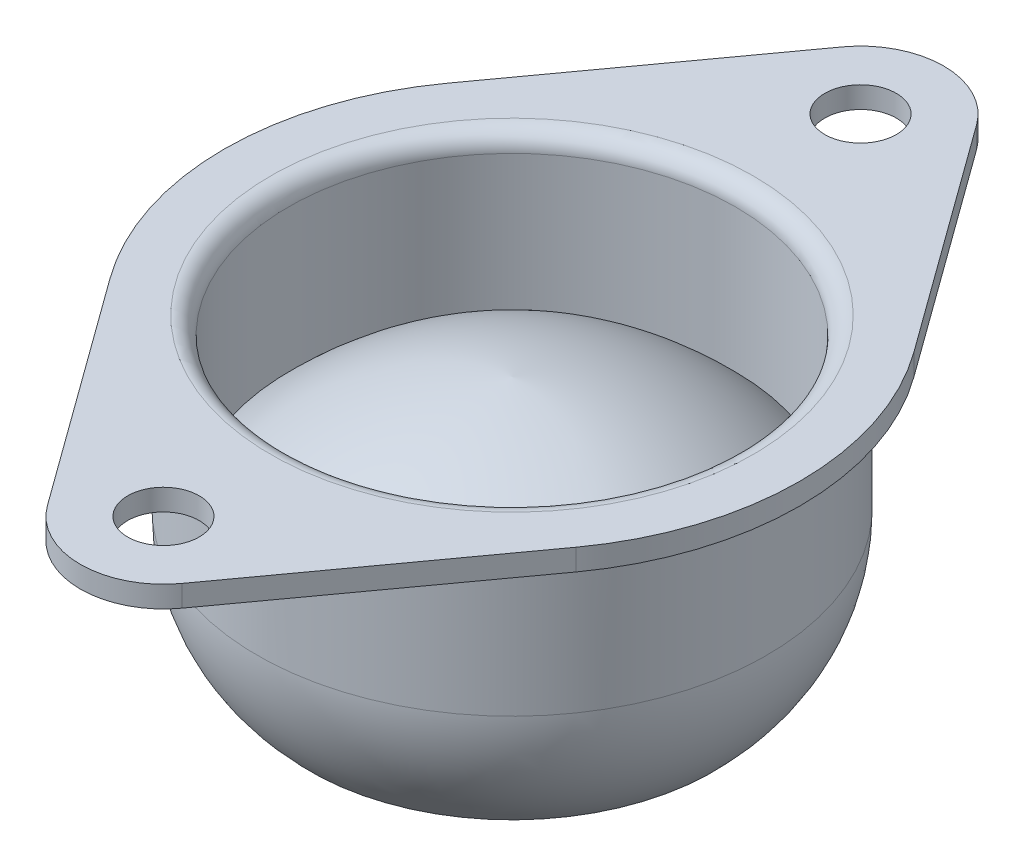
ISO-10303-21;
HEADER;
FILE_DESCRIPTION(('STEP AP214'),'2;1');
FILE_NAME('part.step','',(''),(''),'','','');
FILE_SCHEMA(('AUTOMOTIVE_DESIGN { 1 0 10303 214 1 1 1 1 }'));
ENDSEC;
DATA;
#1=APPLICATION_CONTEXT('core data for automotive mechanical design processes');
#2=APPLICATION_PROTOCOL_DEFINITION('international standard','automotive_design',2000,#1);
#3=PRODUCT_CONTEXT('',#1,'mechanical');
#4=PRODUCT('Part','Part','',(#3));
#5=PRODUCT_RELATED_PRODUCT_CATEGORY('part','',(#4));
#6=PRODUCT_DEFINITION_FORMATION('','',#4);
#7=PRODUCT_DEFINITION_CONTEXT('part definition',#1,'design');
#8=PRODUCT_DEFINITION('design','',#6,#7);
#9=PRODUCT_DEFINITION_SHAPE('','',#8);
#10=(LENGTH_UNIT() NAMED_UNIT(*) SI_UNIT(.MILLI.,.METRE.));
#11=(NAMED_UNIT(*) PLANE_ANGLE_UNIT() SI_UNIT($,.RADIAN.));
#12=(NAMED_UNIT(*) SI_UNIT($,.STERADIAN.) SOLID_ANGLE_UNIT());
#13=UNCERTAINTY_MEASURE_WITH_UNIT(LENGTH_MEASURE(1.E-05),#10,'distance_accuracy_value','');
#14=(GEOMETRIC_REPRESENTATION_CONTEXT(3) GLOBAL_UNCERTAINTY_ASSIGNED_CONTEXT((#13)) GLOBAL_UNIT_ASSIGNED_CONTEXT((#10,
#11,#12)) REPRESENTATION_CONTEXT('',''));
#15=CARTESIAN_POINT('',(0.,0.,0.));
#16=DIRECTION('',(0.,0.,1.));
#17=DIRECTION('',(1.,0.,0.));
#18=AXIS2_PLACEMENT_3D('',#15,#16,#17);
#19=CARTESIAN_POINT('',(0.,-4.21271556201627,0.));
#20=DIRECTION('',(0.,-1.,0.));
#21=DIRECTION('',(0.,0.,-1.));
#22=AXIS2_PLACEMENT_3D('',#19,#20,#21);
#23=CYLINDRICAL_SURFACE('',#22,9.2);
#24=CARTESIAN_POINT('',(0.,-4.21271556201627,0.));
#25=DIRECTION('',(0.,-1.,0.));
#26=DIRECTION('',(0.,0.,-1.));
#27=AXIS2_PLACEMENT_3D('',#24,#25,#26);
#28=CIRCLE('',#27,9.2);
#29=CARTESIAN_POINT('',(-7.44700221203728,-4.21271556201627,5.40205128205128));
#30=VERTEX_POINT('',#29);
#31=CARTESIAN_POINT('',(-7.44700221203728,-4.21271556201627,-5.40205128205128));
#32=VERTEX_POINT('',#31);
#33=EDGE_CURVE('E185',#30,#32,#28,.T.);
#34=ORIENTED_EDGE('',*,*,#33,.T.);
#35=DIRECTION('',(0.,1.,0.));
#36=VECTOR('',#35,1.);
#37=CARTESIAN_POINT('',(-7.44700221203728,-38.0695015819993,-5.40205128205128));
#38=LINE('',#37,#36);
#39=CARTESIAN_POINT('',(-7.44700221203728,-4.89842984773056,-5.40205128205128));
#40=VERTEX_POINT('',#39);
#41=EDGE_CURVE('E165',#40,#32,#38,.T.);
#42=ORIENTED_EDGE('',*,*,#41,.F.);
#43=CARTESIAN_POINT('',(0.,-4.89842984773056,0.));
#44=DIRECTION('',(0.,-1.,0.));
#45=DIRECTION('',(0.,0.,-1.));
#46=AXIS2_PLACEMENT_3D('',#43,#44,#45);
#47=CIRCLE('',#46,9.2);
#48=CARTESIAN_POINT('',(-7.44700221203727,-4.89842984773056,5.40205128205128));
#49=VERTEX_POINT('',#48);
#50=EDGE_CURVE('E181',#49,#40,#47,.T.);
#51=ORIENTED_EDGE('',*,*,#50,.F.);
#52=DIRECTION('',(0.,1.,0.));
#53=VECTOR('',#52,1.);
#54=CARTESIAN_POINT('',(-7.44700221203728,-38.0695015819993,5.40205128205128));
#55=LINE('',#54,#53);
#56=EDGE_CURVE('E53',#49,#30,#55,.T.);
#57=ORIENTED_EDGE('',*,*,#56,.T.);
#58=EDGE_LOOP('',(#34,#42,#51,#57));
#59=FACE_BOUND('',#58,.T.);
#60=ADVANCED_FACE('F38',(#59),#23,.T.);
#61=CARTESIAN_POINT('',(0.,-4.21271556201627,0.));
#62=DIRECTION('',(0.,-1.,0.));
#63=DIRECTION('',(0.,0.,-1.));
#64=AXIS2_PLACEMENT_3D('',#61,#62,#63);
#65=PLANE('',#64);
#66=CARTESIAN_POINT('',(0.,-4.21271556201627,0.));
#67=DIRECTION('',(0.,-1.,0.));
#68=DIRECTION('',(0.,0.,-1.));
#69=AXIS2_PLACEMENT_3D('',#66,#67,#68);
#70=CIRCLE('',#69,7.71428571428572);
#71=CARTESIAN_POINT('',(0.,-4.21271556201627,-7.71428571428572));
#72=VERTEX_POINT('',#71);
#73=EDGE_CURVE('E192',#72,#72,#70,.T.);
#74=ORIENTED_EDGE('',*,*,#73,.T.);
#75=EDGE_LOOP('',(#74));
#76=FACE_BOUND('',#75,.T.);
#77=CARTESIAN_POINT('',(7.44700221203728,-4.21271556201627,-5.40205128205128));
#78=VERTEX_POINT('',#77);
#79=CARTESIAN_POINT('',(7.44700221203728,-4.21271556201627,5.40205128205128));
#80=VERTEX_POINT('',#79);
#81=EDGE_CURVE('E186',#78,#80,#28,.T.);
#82=ORIENTED_EDGE('',*,*,#81,.F.);
#83=DIRECTION('',(0.587179487179487,0.,0.809456762177965));
#84=VECTOR('',#83,1.);
#85=CARTESIAN_POINT('',(7.44700221203727,-4.21271556201627,-5.40205128205128));
#86=LINE('',#85,#84);
#87=CARTESIAN_POINT('',(2.15084225378716,-4.21271556201627,-12.7030769230769));
#88=VERTEX_POINT('',#87);
#89=EDGE_CURVE('E119',#88,#78,#86,.T.);
#90=ORIENTED_EDGE('',*,*,#89,.F.);
#91=CARTESIAN_POINT('',(0.,-4.21271556201627,-11.1428571428571));
#92=DIRECTION('',(0.,1.,0.));
#93=DIRECTION('',(0.,0.,1.));
#94=AXIS2_PLACEMENT_3D('',#91,#92,#93);
#95=CIRCLE('',#94,2.65714285714286);
#96=CARTESIAN_POINT('',(-2.15084225378716,-4.21271556201627,-12.7030769230769));
#97=VERTEX_POINT('',#96);
#98=EDGE_CURVE('E139',#88,#97,#95,.T.);
#99=ORIENTED_EDGE('',*,*,#98,.T.);
#100=DIRECTION('',(-0.587179487179487,0.,0.809456762177965));
#101=VECTOR('',#100,1.);
#102=CARTESIAN_POINT('',(-7.44700221203728,-4.21271556201627,-5.40205128205128));
#103=LINE('',#102,#101);
#104=EDGE_CURVE('E142',#97,#32,#103,.T.);
#105=ORIENTED_EDGE('',*,*,#104,.T.);
#106=ORIENTED_EDGE('',*,*,#33,.F.);
#107=DIRECTION('',(-0.587179487179487,0.,-0.809456762177965));
#108=VECTOR('',#107,1.);
#109=CARTESIAN_POINT('',(-7.44700221203728,-4.21271556201627,5.40205128205128));
#110=LINE('',#109,#108);
#111=CARTESIAN_POINT('',(-2.15084225378716,-4.21271556201627,12.7030769230769));
#112=VERTEX_POINT('',#111);
#113=EDGE_CURVE('E145',#112,#30,#110,.T.);
#114=ORIENTED_EDGE('',*,*,#113,.F.);
#115=CARTESIAN_POINT('',(0.,-4.21271556201627,11.1428571428571));
#116=DIRECTION('',(0.,1.,0.));
#117=DIRECTION('',(0.,0.,1.));
#118=AXIS2_PLACEMENT_3D('',#115,#116,#117);
#119=CIRCLE('',#118,2.65714285714286);
#120=CARTESIAN_POINT('',(2.15084225378716,-4.21271556201627,12.7030769230769));
#121=VERTEX_POINT('',#120);
#122=EDGE_CURVE('E147',#112,#121,#119,.T.);
#123=ORIENTED_EDGE('',*,*,#122,.T.);
#124=DIRECTION('',(0.587179487179487,0.,-0.809456762177965));
#125=VECTOR('',#124,1.);
#126=CARTESIAN_POINT('',(7.44700221203727,-4.21271556201627,5.40205128205128));
#127=LINE('',#126,#125);
#128=EDGE_CURVE('E150',#121,#80,#127,.T.);
#129=ORIENTED_EDGE('',*,*,#128,.T.);
#130=EDGE_LOOP('',(#82,#90,#99,#105,#106,#114,#123,#129));
#131=FACE_BOUND('',#130,.T.);
#132=CARTESIAN_POINT('',(0.,-4.21271556201627,11.1428571428571));
#133=DIRECTION('',(0.,1.,0.));
#134=DIRECTION('',(0.,0.,1.));
#135=AXIS2_PLACEMENT_3D('',#132,#133,#134);
#136=CIRCLE('',#135,1.14285714285714);
#137=CARTESIAN_POINT('',(0.,-4.21271556201627,12.2857142857143));
#138=VERTEX_POINT('',#137);
#139=EDGE_CURVE('E153',#138,#138,#136,.T.);
#140=ORIENTED_EDGE('',*,*,#139,.F.);
#141=EDGE_LOOP('',(#140));
#142=FACE_BOUND('',#141,.T.);
#143=CARTESIAN_POINT('',(0.,-4.21271556201627,-11.1428571428571));
#144=DIRECTION('',(0.,1.,0.));
#145=DIRECTION('',(0.,0.,1.));
#146=AXIS2_PLACEMENT_3D('',#143,#144,#145);
#147=CIRCLE('',#146,1.14285714285714);
#148=CARTESIAN_POINT('',(0.,-4.21271556201627,-10.));
#149=VERTEX_POINT('',#148);
#150=EDGE_CURVE('E116',#149,#149,#147,.T.);
#151=ORIENTED_EDGE('',*,*,#150,.F.);
#152=EDGE_LOOP('',(#151));
#153=FACE_BOUND('',#152,.T.);
#154=ADVANCED_FACE('F209',(#76,#131,#142,#153),#65,.F.);
#155=ORIENTED_EDGE('',*,*,#81,.T.);
#156=DIRECTION('',(0.,1.,0.));
#157=VECTOR('',#156,1.);
#158=CARTESIAN_POINT('',(7.44700221203728,-38.0695015819993,5.40205128205128));
#159=LINE('',#158,#157);
#160=CARTESIAN_POINT('',(7.44700221203727,-4.89842984773056,5.40205128205128));
#161=VERTEX_POINT('',#160);
#162=EDGE_CURVE('E158',#161,#80,#159,.T.);
#163=ORIENTED_EDGE('',*,*,#162,.F.);
#164=CARTESIAN_POINT('',(7.44700221203727,-4.89842984773056,-5.40205128205128));
#165=VERTEX_POINT('',#164);
#166=EDGE_CURVE('E182',#165,#161,#47,.T.);
#167=ORIENTED_EDGE('',*,*,#166,.F.);
#168=DIRECTION('',(0.,1.,0.));
#169=VECTOR('',#168,1.);
#170=CARTESIAN_POINT('',(7.44700221203728,-38.0695015819993,-5.40205128205128));
#171=LINE('',#170,#169);
#172=EDGE_CURVE('E61',#165,#78,#171,.T.);
#173=ORIENTED_EDGE('',*,*,#172,.T.);
#174=EDGE_LOOP('',(#155,#163,#167,#173));
#175=FACE_BOUND('',#174,.T.);
#176=ADVANCED_FACE('F212',(#175),#23,.T.);
#177=CARTESIAN_POINT('',(-9.2,-4.89842984773056,0.));
#178=DIRECTION('',(0.,1.,0.));
#179=DIRECTION('',(0.,0.,1.));
#180=AXIS2_PLACEMENT_3D('',#177,#178,#179);
#181=PLANE('',#180);
#182=CARTESIAN_POINT('',(0.,-4.89842984773056,0.));
#183=DIRECTION('',(0.,1.,0.));
#184=DIRECTION('',(0.,0.,1.));
#185=AXIS2_PLACEMENT_3D('',#182,#183,#184);
#186=CIRCLE('',#185,8.71428571428571);
#187=CARTESIAN_POINT('',(0.,-4.89842984773056,8.71428571428571));
#188=VERTEX_POINT('',#187);
#189=EDGE_CURVE('E11',#188,#188,#186,.T.);
#190=ORIENTED_EDGE('',*,*,#189,.T.);
#191=EDGE_LOOP('',(#190));
#192=FACE_BOUND('',#191,.T.);
#193=ORIENTED_EDGE('',*,*,#166,.T.);
#194=DIRECTION('',(-0.587179487179487,0.,0.809456762177965));
#195=VECTOR('',#194,1.);
#196=CARTESIAN_POINT('',(7.44700221203727,-4.89842984773056,5.40205128205128));
#197=LINE('',#196,#195);
#198=CARTESIAN_POINT('',(2.15084225378716,-4.89842984773056,12.7030769230769));
#199=VERTEX_POINT('',#198);
#200=EDGE_CURVE('E135',#161,#199,#197,.T.);
#201=ORIENTED_EDGE('',*,*,#200,.T.);
#202=CARTESIAN_POINT('',(0.,-4.89842984773056,11.1428571428571));
#203=DIRECTION('',(0.,1.,0.));
#204=DIRECTION('',(0.,0.,1.));
#205=AXIS2_PLACEMENT_3D('',#202,#203,#204);
#206=CIRCLE('',#205,2.65714285714286);
#207=CARTESIAN_POINT('',(-2.15084225378716,-4.89842984773056,12.7030769230769));
#208=VERTEX_POINT('',#207);
#209=EDGE_CURVE('E133',#199,#208,#206,.F.);
#210=ORIENTED_EDGE('',*,*,#209,.T.);
#211=DIRECTION('',(0.587179487179487,0.,0.809456762177965));
#212=VECTOR('',#211,1.);
#213=CARTESIAN_POINT('',(-7.44700221203728,-4.89842984773056,5.40205128205128));
#214=LINE('',#213,#212);
#215=EDGE_CURVE('E131',#49,#208,#214,.T.);
#216=ORIENTED_EDGE('',*,*,#215,.F.);
#217=ORIENTED_EDGE('',*,*,#50,.T.);
#218=DIRECTION('',(0.587179487179487,0.,-0.809456762177965));
#219=VECTOR('',#218,1.);
#220=CARTESIAN_POINT('',(-7.44700221203728,-4.89842984773056,-5.40205128205128));
#221=LINE('',#220,#219);
#222=CARTESIAN_POINT('',(-2.15084225378716,-4.89842984773056,-12.7030769230769));
#223=VERTEX_POINT('',#222);
#224=EDGE_CURVE('E129',#40,#223,#221,.T.);
#225=ORIENTED_EDGE('',*,*,#224,.T.);
#226=CARTESIAN_POINT('',(0.,-4.89842984773056,-11.1428571428571));
#227=DIRECTION('',(0.,1.,0.));
#228=DIRECTION('',(0.,0.,1.));
#229=AXIS2_PLACEMENT_3D('',#226,#227,#228);
#230=CIRCLE('',#229,2.65714285714286);
#231=CARTESIAN_POINT('',(2.15084225378716,-4.89842984773056,-12.7030769230769));
#232=VERTEX_POINT('',#231);
#233=EDGE_CURVE('E126',#223,#232,#230,.F.);
#234=ORIENTED_EDGE('',*,*,#233,.T.);
#235=DIRECTION('',(-0.587179487179487,0.,-0.809456762177965));
#236=VECTOR('',#235,1.);
#237=CARTESIAN_POINT('',(7.44700221203727,-4.89842984773056,-5.40205128205128));
#238=LINE('',#237,#236);
#239=EDGE_CURVE('E128',#165,#232,#238,.T.);
#240=ORIENTED_EDGE('',*,*,#239,.F.);
#241=EDGE_LOOP('',(#193,#201,#210,#216,#217,#225,#234,#240));
#242=FACE_BOUND('',#241,.T.);
#243=CARTESIAN_POINT('',(0.,-4.89842984773056,11.1428571428571));
#244=DIRECTION('',(0.,1.,0.));
#245=DIRECTION('',(0.,0.,1.));
#246=AXIS2_PLACEMENT_3D('',#243,#244,#245);
#247=CIRCLE('',#246,1.14285714285714);
#248=CARTESIAN_POINT('',(0.,-4.89842984773056,12.2857142857143));
#249=VERTEX_POINT('',#248);
#250=EDGE_CURVE('E125',#249,#249,#247,.F.);
#251=ORIENTED_EDGE('',*,*,#250,.F.);
#252=EDGE_LOOP('',(#251));
#253=FACE_BOUND('',#252,.T.);
#254=CARTESIAN_POINT('',(0.,-4.89842984773056,-11.1428571428571));
#255=DIRECTION('',(0.,1.,0.));
#256=DIRECTION('',(0.,0.,1.));
#257=AXIS2_PLACEMENT_3D('',#254,#255,#256);
#258=CIRCLE('',#257,1.14285714285714);
#259=CARTESIAN_POINT('',(0.,-4.89842984773056,-10.));
#260=VERTEX_POINT('',#259);
#261=EDGE_CURVE('E122',#260,#260,#258,.F.);
#262=ORIENTED_EDGE('',*,*,#261,.F.);
#263=EDGE_LOOP('',(#262));
#264=FACE_BOUND('',#263,.T.);
#265=ADVANCED_FACE('F221',(#192,#242,#253,#264),#181,.F.);
#266=CARTESIAN_POINT('',(0.,-4.21271556201627,0.));
#267=DIRECTION('',(0.,-1.,0.));
#268=DIRECTION('',(0.,0.,-1.));
#269=AXIS2_PLACEMENT_3D('',#266,#267,#268);
#270=CYLINDRICAL_SURFACE('',#269,8.14285714285714);
#271=CARTESIAN_POINT('',(0.,-5.46985841915913,0.));
#272=DIRECTION('',(0.,1.,0.));
#273=DIRECTION('',(0.,0.,1.));
#274=AXIS2_PLACEMENT_3D('',#271,#272,#273);
#275=CIRCLE('',#274,8.14285714285714);
#276=CARTESIAN_POINT('',(0.,-5.46985841915913,8.14285714285714));
#277=VERTEX_POINT('',#276);
#278=EDGE_CURVE('E46',#277,#277,#275,.F.);
#279=ORIENTED_EDGE('',*,*,#278,.T.);
#280=EDGE_LOOP('',(#279));
#281=FACE_BOUND('',#280,.T.);
#282=CARTESIAN_POINT('',(0.,-9.56047074570608,0.));
#283=DIRECTION('',(0.,-1.,0.));
#284=DIRECTION('',(0.,0.,-1.));
#285=AXIS2_PLACEMENT_3D('',#282,#283,#284);
#286=CIRCLE('',#285,8.14285714285714);
#287=CARTESIAN_POINT('',(0.,-9.56047074570608,-8.14285714285714));
#288=VERTEX_POINT('',#287);
#289=EDGE_CURVE('E178',#288,#288,#286,.T.);
#290=ORIENTED_EDGE('',*,*,#289,.F.);
#291=EDGE_LOOP('',(#290));
#292=FACE_BOUND('',#291,.T.);
#293=ADVANCED_FACE('F197',(#281,#292),#270,.T.);
#294=CARTESIAN_POINT('',(0.,-9.56047074570608,0.));
#295=DIRECTION('',(0.,-1.,0.));
#296=DIRECTION('',(0.,0.,-1.));
#297=AXIS2_PLACEMENT_3D('',#294,#295,#296);
#298=DEGENERATE_TOROIDAL_SURFACE('',#297,2.42857142857143,5.71428571428571,.T.);
#299=CARTESIAN_POINT('',(0.,-13.6412869905877,0.));
#300=DIRECTION('',(0.,-1.,0.));
#301=DIRECTION('',(0.,0.,-1.));
#302=AXIS2_PLACEMENT_3D('',#299,#300,#301);
#303=CIRCLE('',#302,6.42857142857143);
#304=CARTESIAN_POINT('',(0.,-13.6412869905877,-6.42857142857143));
#305=VERTEX_POINT('',#304);
#306=EDGE_CURVE('E175',#305,#305,#303,.T.);
#307=ORIENTED_EDGE('',*,*,#306,.F.);
#308=EDGE_LOOP('',(#307));
#309=FACE_BOUND('',#308,.T.);
#310=ORIENTED_EDGE('',*,*,#289,.T.);
#311=EDGE_LOOP('',(#310));
#312=FACE_BOUND('',#311,.T.);
#313=ADVANCED_FACE('F278',(#309,#312),#298,.T.);
#314=CARTESIAN_POINT('',(0.,-12.179534854485,0.));
#315=DIRECTION('',(0.,-1.,0.));
#316=DIRECTION('',(0.,0.,-1.));
#317=AXIS2_PLACEMENT_3D('',#314,#315,#316);
#318=TOROIDAL_SURFACE('',#317,5.53299552290893,1.71428571428571);
#319=CARTESIAN_POINT('',(0.,-13.3555727048734,0.));
#320=DIRECTION('',(0.,-1.,0.));
#321=DIRECTION('',(0.,0.,-1.));
#322=AXIS2_PLACEMENT_3D('',#319,#320,#321);
#323=CIRCLE('',#322,4.28571428571429);
#324=CARTESIAN_POINT('',(0.,-13.3555727048734,-4.28571428571429));
#325=VERTEX_POINT('',#324);
#326=EDGE_CURVE('E172',#325,#325,#323,.T.);
#327=ORIENTED_EDGE('',*,*,#326,.F.);
#328=EDGE_LOOP('',(#327));
#329=FACE_BOUND('',#328,.T.);
#330=ORIENTED_EDGE('',*,*,#306,.T.);
#331=EDGE_LOOP('',(#330));
#332=FACE_BOUND('',#331,.T.);
#333=ADVANCED_FACE('F274',(#329,#332),#318,.T.);
#334=CARTESIAN_POINT('',(0.,-11.5698584191591,0.));
#335=DIRECTION('',(0.,-1.,0.));
#336=DIRECTION('',(-1.,0.,0.));
#337=AXIS2_PLACEMENT_3D('',#334,#335,#336);
#338=SPHERICAL_SURFACE('',#337,4.64285714285714);
#339=ORIENTED_EDGE('',*,*,#326,.T.);
#340=EDGE_LOOP('',(#339));
#341=FACE_BOUND('',#340,.T.);
#342=ADVANCED_FACE('F271',(#341),#338,.T.);
#343=CARTESIAN_POINT('',(0.,-38.0695015819993,11.1428571428571));
#344=DIRECTION('',(0.,1.,0.));
#345=DIRECTION('',(0.,0.,1.));
#346=AXIS2_PLACEMENT_3D('',#343,#344,#345);
#347=CYLINDRICAL_SURFACE('',#346,2.65714285714286);
#348=ORIENTED_EDGE('',*,*,#209,.F.);
#349=DIRECTION('',(0.,1.,0.));
#350=VECTOR('',#349,1.);
#351=CARTESIAN_POINT('',(2.15084225378716,-38.0695015819993,12.7030769230769));
#352=LINE('',#351,#350);
#353=EDGE_CURVE('E160',#199,#121,#352,.T.);
#354=ORIENTED_EDGE('',*,*,#353,.T.);
#355=ORIENTED_EDGE('',*,*,#122,.F.);
#356=DIRECTION('',(0.,1.,0.));
#357=VECTOR('',#356,1.);
#358=CARTESIAN_POINT('',(-2.15084225378716,-38.0695015819993,12.7030769230769));
#359=LINE('',#358,#357);
#360=EDGE_CURVE('E162',#208,#112,#359,.T.);
#361=ORIENTED_EDGE('',*,*,#360,.F.);
#362=EDGE_LOOP('',(#348,#354,#355,#361));
#363=FACE_BOUND('',#362,.T.);
#364=ADVANCED_FACE('F245',(#363),#347,.T.);
#365=CARTESIAN_POINT('',(0.,-38.0695015819993,11.1428571428571));
#366=DIRECTION('',(0.,1.,0.));
#367=DIRECTION('',(0.,0.,1.));
#368=AXIS2_PLACEMENT_3D('',#365,#366,#367);
#369=CYLINDRICAL_SURFACE('',#368,1.14285714285714);
#370=ORIENTED_EDGE('',*,*,#250,.T.);
#371=EDGE_LOOP('',(#370));
#372=FACE_BOUND('',#371,.T.);
#373=ORIENTED_EDGE('',*,*,#139,.T.);
#374=EDGE_LOOP('',(#373));
#375=FACE_BOUND('',#374,.T.);
#376=ADVANCED_FACE('F306',(#372,#375),#369,.F.);
#377=CARTESIAN_POINT('',(7.44700221203727,-38.0695015819993,5.40205128205128));
#378=DIRECTION('',(0.809456762177965,0.,0.587179487179487));
#379=DIRECTION('',(0.587179487179487,0.,-0.809456762177965));
#380=AXIS2_PLACEMENT_3D('',#377,#378,#379);
#381=PLANE('',#380);
#382=ORIENTED_EDGE('',*,*,#200,.F.);
#383=ORIENTED_EDGE('',*,*,#162,.T.);
#384=ORIENTED_EDGE('',*,*,#128,.F.);
#385=ORIENTED_EDGE('',*,*,#353,.F.);
#386=EDGE_LOOP('',(#382,#383,#384,#385));
#387=FACE_BOUND('',#386,.T.);
#388=ADVANCED_FACE('F239',(#387),#381,.T.);
#389=CARTESIAN_POINT('',(-7.44700221203728,-38.0695015819993,5.40205128205128));
#390=DIRECTION('',(0.809456762177965,0.,-0.587179487179487));
#391=DIRECTION('',(-0.587179487179487,0.,-0.809456762177965));
#392=AXIS2_PLACEMENT_3D('',#389,#390,#391);
#393=PLANE('',#392);
#394=ORIENTED_EDGE('',*,*,#56,.F.);
#395=ORIENTED_EDGE('',*,*,#215,.T.);
#396=ORIENTED_EDGE('',*,*,#360,.T.);
#397=ORIENTED_EDGE('',*,*,#113,.T.);
#398=EDGE_LOOP('',(#394,#395,#396,#397));
#399=FACE_BOUND('',#398,.T.);
#400=ADVANCED_FACE('F246',(#399),#393,.F.);
#401=CARTESIAN_POINT('',(0.,-38.0695015819993,-11.1428571428571));
#402=DIRECTION('',(0.,1.,0.));
#403=DIRECTION('',(0.,0.,1.));
#404=AXIS2_PLACEMENT_3D('',#401,#402,#403);
#405=CYLINDRICAL_SURFACE('',#404,2.65714285714286);
#406=ORIENTED_EDGE('',*,*,#233,.F.);
#407=DIRECTION('',(0.,1.,0.));
#408=VECTOR('',#407,1.);
#409=CARTESIAN_POINT('',(-2.15084225378716,-38.0695015819993,-12.7030769230769));
#410=LINE('',#409,#408);
#411=EDGE_CURVE('E167',#223,#97,#410,.T.);
#412=ORIENTED_EDGE('',*,*,#411,.T.);
#413=ORIENTED_EDGE('',*,*,#98,.F.);
#414=DIRECTION('',(0.,1.,0.));
#415=VECTOR('',#414,1.);
#416=CARTESIAN_POINT('',(2.15084225378716,-38.0695015819993,-12.7030769230769));
#417=LINE('',#416,#415);
#418=EDGE_CURVE('E156',#232,#88,#417,.T.);
#419=ORIENTED_EDGE('',*,*,#418,.F.);
#420=EDGE_LOOP('',(#406,#412,#413,#419));
#421=FACE_BOUND('',#420,.T.);
#422=ADVANCED_FACE('F258',(#421),#405,.T.);
#423=CARTESIAN_POINT('',(-7.44700221203728,-38.0695015819993,-5.40205128205128));
#424=DIRECTION('',(-0.809456762177965,0.,-0.587179487179487));
#425=DIRECTION('',(-0.587179487179487,0.,0.809456762177965));
#426=AXIS2_PLACEMENT_3D('',#423,#424,#425);
#427=PLANE('',#426);
#428=ORIENTED_EDGE('',*,*,#224,.F.);
#429=ORIENTED_EDGE('',*,*,#41,.T.);
#430=ORIENTED_EDGE('',*,*,#104,.F.);
#431=ORIENTED_EDGE('',*,*,#411,.F.);
#432=EDGE_LOOP('',(#428,#429,#430,#431));
#433=FACE_BOUND('',#432,.T.);
#434=ADVANCED_FACE('F255',(#433),#427,.T.);
#435=CARTESIAN_POINT('',(7.44700221203727,-38.0695015819993,-5.40205128205128));
#436=DIRECTION('',(-0.809456762177965,0.,0.587179487179487));
#437=DIRECTION('',(0.587179487179487,0.,0.809456762177965));
#438=AXIS2_PLACEMENT_3D('',#435,#436,#437);
#439=PLANE('',#438);
#440=ORIENTED_EDGE('',*,*,#172,.F.);
#441=ORIENTED_EDGE('',*,*,#239,.T.);
#442=ORIENTED_EDGE('',*,*,#418,.T.);
#443=ORIENTED_EDGE('',*,*,#89,.T.);
#444=EDGE_LOOP('',(#440,#441,#442,#443));
#445=FACE_BOUND('',#444,.T.);
#446=ADVANCED_FACE('F259',(#445),#439,.F.);
#447=CARTESIAN_POINT('',(0.,-38.0695015819993,-11.1428571428571));
#448=DIRECTION('',(0.,1.,0.));
#449=DIRECTION('',(0.,0.,1.));
#450=AXIS2_PLACEMENT_3D('',#447,#448,#449);
#451=CYLINDRICAL_SURFACE('',#450,1.14285714285714);
#452=ORIENTED_EDGE('',*,*,#261,.T.);
#453=EDGE_LOOP('',(#452));
#454=FACE_BOUND('',#453,.T.);
#455=ORIENTED_EDGE('',*,*,#150,.T.);
#456=EDGE_LOOP('',(#455));
#457=FACE_BOUND('',#456,.T.);
#458=ADVANCED_FACE('F110',(#454,#457),#451,.F.);
#459=CARTESIAN_POINT('',(0.,-17.3056127936304,-1.0674478140319));
#460=DIRECTION('',(-1.,0.,0.));
#461=DIRECTION('',(0.,0.,1.));
#462=AXIS2_PLACEMENT_3D('',#459,#460,#461);
#463=CIRCLE('',#462,11.4285714285714);
#464=TRIMMED_CURVE('',#463,(PARAMETER_VALUE(-1.47725830305523)),
(PARAMETER_VALUE(1.47725830305523)),.T.,.PARAMETER.);
#465=CARTESIAN_POINT('',(0.,-17.3056127936304,0.));
#466=DIRECTION('',(0.,1.,0.));
#467=AXIS1_PLACEMENT('',#465,#466);
#468=SURFACE_OF_REVOLUTION('',#464,#467);
#469=CARTESIAN_POINT('',(0.,-5.92700127630199,0.));
#470=VERTEX_POINT('',#469);
#471=VERTEX_LOOP('',#470);
#472=FACE_BOUND('',#471,.T.);
#473=CARTESIAN_POINT('',(0.,-9.35557270487342,0.));
#474=DIRECTION('',(0.,1.,0.));
#475=DIRECTION('',(0.,0.,1.));
#476=AXIS2_PLACEMENT_3D('',#473,#474,#475);
#477=CIRCLE('',#476,7.14285714285714);
#478=CARTESIAN_POINT('',(0.,-9.35557270487342,7.14285714285714));
#479=VERTEX_POINT('',#478);
#480=EDGE_CURVE('E114',#479,#479,#477,.T.);
#481=ORIENTED_EDGE('',*,*,#480,.T.);
#482=EDGE_LOOP('',(#481));
#483=FACE_BOUND('',#482,.T.);
#484=ADVANCED_FACE('F106',(#472,#483),#468,.T.);
#485=CARTESIAN_POINT('',(0.,-4.21271556201627,0.));
#486=DIRECTION('',(0.,1.,0.));
#487=DIRECTION('',(0.,0.,1.));
#488=AXIS2_PLACEMENT_3D('',#485,#486,#487);
#489=CYLINDRICAL_SURFACE('',#488,7.14285714285714);
#490=CARTESIAN_POINT('',(0.,-4.78414413344484,0.));
#491=DIRECTION('',(0.,-1.,0.));
#492=DIRECTION('',(0.,0.,-1.));
#493=AXIS2_PLACEMENT_3D('',#490,#491,#492);
#494=CIRCLE('',#493,7.14285714285714);
#495=CARTESIAN_POINT('',(0.,-4.78414413344484,-7.14285714285714));
#496=VERTEX_POINT('',#495);
#497=EDGE_CURVE('E189',#496,#496,#494,.F.);
#498=ORIENTED_EDGE('',*,*,#497,.T.);
#499=EDGE_LOOP('',(#498));
#500=FACE_BOUND('',#499,.T.);
#501=ORIENTED_EDGE('',*,*,#480,.F.);
#502=EDGE_LOOP('',(#501));
#503=FACE_BOUND('',#502,.T.);
#504=ADVANCED_FACE('F109',(#500,#503),#489,.F.);
#505=CARTESIAN_POINT('',(0.,-4.78414413344484,0.));
#506=DIRECTION('',(0.,-1.,0.));
#507=DIRECTION('',(0.,0.,-1.));
#508=AXIS2_PLACEMENT_3D('',#505,#506,#507);
#509=TOROIDAL_SURFACE('',#508,7.71428571428572,0.571428571428571);
#510=ORIENTED_EDGE('',*,*,#73,.F.);
#511=EDGE_LOOP('',(#510));
#512=FACE_BOUND('',#511,.T.);
#513=ORIENTED_EDGE('',*,*,#497,.F.);
#514=EDGE_LOOP('',(#513));
#515=FACE_BOUND('',#514,.T.);
#516=ADVANCED_FACE('F201',(#512,#515),#509,.T.);
#517=CARTESIAN_POINT('',(0.,-5.46985841915913,0.));
#518=DIRECTION('',(0.,1.,0.));
#519=DIRECTION('',(0.,0.,1.));
#520=AXIS2_PLACEMENT_3D('',#517,#518,#519);
#521=TOROIDAL_SURFACE('',#520,8.71428571428571,0.571428571428571);
#522=ORIENTED_EDGE('',*,*,#189,.F.);
#523=EDGE_LOOP('',(#522));
#524=FACE_BOUND('',#523,.T.);
#525=ORIENTED_EDGE('',*,*,#278,.F.);
#526=EDGE_LOOP('',(#525));
#527=FACE_BOUND('',#526,.T.);
#528=ADVANCED_FACE('F40',(#524,#527),#521,.F.);
#529=CLOSED_SHELL('',(#60,#154,#176,#265,#293,#313,#333,#342,#364,#376,#388,#400,#422,#434,#446,
#458,#484,#504,#516,#528));
#530=MANIFOLD_SOLID_BREP('B2',#529);
#531=ADVANCED_BREP_SHAPE_REPRESENTATION('',(#18,#530),#14);
#532=SHAPE_DEFINITION_REPRESENTATION(#9,#531);
ENDSEC;
END-ISO-10303-21;
